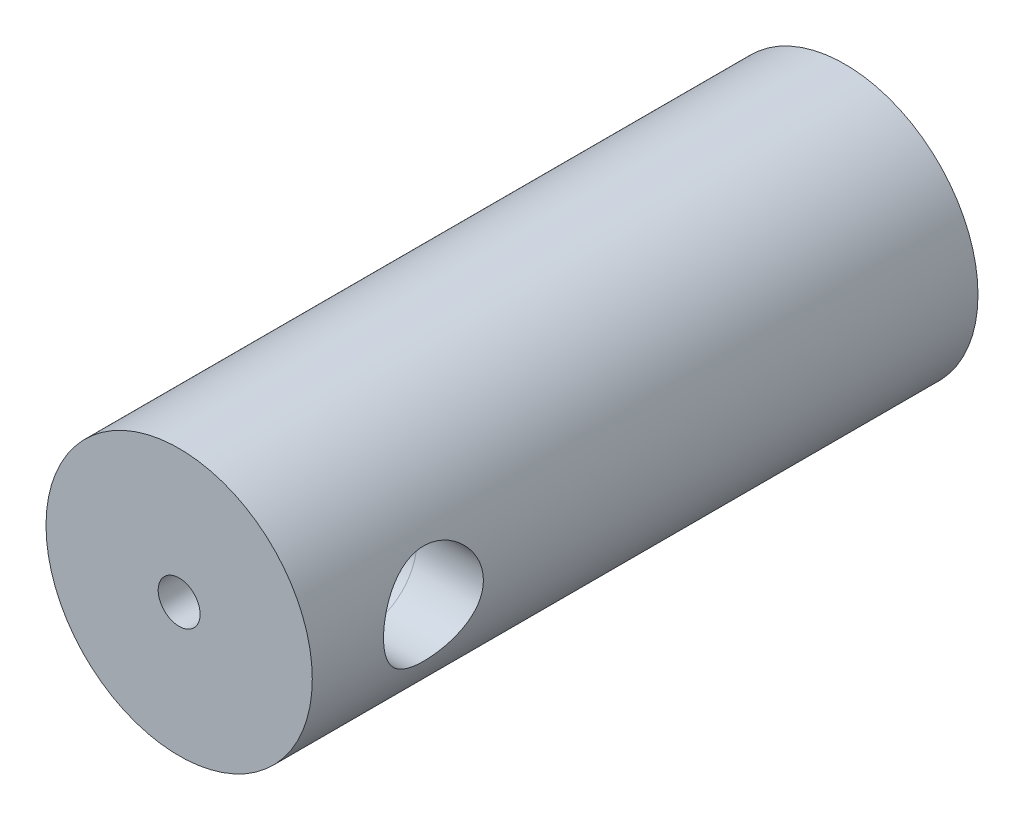
ISO-10303-21;
HEADER;
FILE_DESCRIPTION(('STEP AP214'),'2;1');
FILE_NAME('part.step','',(''),(''),'','','');
FILE_SCHEMA(('AUTOMOTIVE_DESIGN { 1 0 10303 214 1 1 1 1 }'));
ENDSEC;
DATA;
#1=APPLICATION_CONTEXT('core data for automotive mechanical design processes');
#2=APPLICATION_PROTOCOL_DEFINITION('international standard','automotive_design',2000,#1);
#3=PRODUCT_CONTEXT('',#1,'mechanical');
#4=PRODUCT('Part','Part','',(#3));
#5=PRODUCT_RELATED_PRODUCT_CATEGORY('part','',(#4));
#6=PRODUCT_DEFINITION_FORMATION('','',#4);
#7=PRODUCT_DEFINITION_CONTEXT('part definition',#1,'design');
#8=PRODUCT_DEFINITION('design','',#6,#7);
#9=PRODUCT_DEFINITION_SHAPE('','',#8);
#10=(LENGTH_UNIT() NAMED_UNIT(*) SI_UNIT(.MILLI.,.METRE.));
#11=(NAMED_UNIT(*) PLANE_ANGLE_UNIT() SI_UNIT($,.RADIAN.));
#12=(NAMED_UNIT(*) SI_UNIT($,.STERADIAN.) SOLID_ANGLE_UNIT());
#13=UNCERTAINTY_MEASURE_WITH_UNIT(LENGTH_MEASURE(1.E-05),#10,'distance_accuracy_value','');
#14=(GEOMETRIC_REPRESENTATION_CONTEXT(3) GLOBAL_UNCERTAINTY_ASSIGNED_CONTEXT((#13)) GLOBAL_UNIT_ASSIGNED_CONTEXT((#10,
#11,#12)) REPRESENTATION_CONTEXT('',''));
#15=CARTESIAN_POINT('',(0.,0.,0.));
#16=DIRECTION('',(0.,0.,1.));
#17=DIRECTION('',(1.,0.,0.));
#18=AXIS2_PLACEMENT_3D('',#15,#16,#17);
#19=CARTESIAN_POINT('',(0.,0.,0.));
#20=DIRECTION('',(0.,0.,1.));
#21=DIRECTION('',(1.,0.,0.));
#22=AXIS2_PLACEMENT_3D('',#19,#20,#21);
#23=PLANE('',#22);
#24=CARTESIAN_POINT('',(0.,0.,0.));
#25=DIRECTION('',(0.,0.,1.));
#26=DIRECTION('',(1.,0.,0.));
#27=AXIS2_PLACEMENT_3D('',#24,#25,#26);
#28=CIRCLE('',#27,20.);
#29=CARTESIAN_POINT('',(20.,0.,0.));
#30=VERTEX_POINT('',#29);
#31=EDGE_CURVE('E134',#30,#30,#28,.T.);
#32=ORIENTED_EDGE('',*,*,#31,.F.);
#33=EDGE_LOOP('',(#32));
#34=FACE_BOUND('',#33,.T.);
#35=CARTESIAN_POINT('',(0.,0.,0.));
#36=DIRECTION('',(0.,0.,1.));
#37=DIRECTION('',(1.,0.,0.));
#38=AXIS2_PLACEMENT_3D('',#35,#36,#37);
#39=CIRCLE('',#38,9.75);
#40=CARTESIAN_POINT('',(-2.5,9.42403841248538,0.));
#41=VERTEX_POINT('',#40);
#42=CARTESIAN_POINT('',(2.5,9.42403841248538,0.));
#43=VERTEX_POINT('',#42);
#44=EDGE_CURVE('E116',#41,#43,#39,.T.);
#45=ORIENTED_EDGE('',*,*,#44,.T.);
#46=DIRECTION('',(0.,-1.,0.));
#47=VECTOR('',#46,1.);
#48=CARTESIAN_POINT('',(2.5,13.75,0.));
#49=LINE('',#48,#47);
#50=CARTESIAN_POINT('',(2.5,13.75,0.));
#51=VERTEX_POINT('',#50);
#52=EDGE_CURVE('E103',#51,#43,#49,.T.);
#53=ORIENTED_EDGE('',*,*,#52,.F.);
#54=DIRECTION('',(-1.,0.,0.));
#55=VECTOR('',#54,1.);
#56=CARTESIAN_POINT('',(2.5,13.75,0.));
#57=LINE('',#56,#55);
#58=CARTESIAN_POINT('',(-2.5,13.75,0.));
#59=VERTEX_POINT('',#58);
#60=EDGE_CURVE('E109',#51,#59,#57,.T.);
#61=ORIENTED_EDGE('',*,*,#60,.T.);
#62=DIRECTION('',(0.,-1.,0.));
#63=VECTOR('',#62,1.);
#64=CARTESIAN_POINT('',(-2.5,13.75,0.));
#65=LINE('',#64,#63);
#66=EDGE_CURVE('E113',#59,#41,#65,.T.);
#67=ORIENTED_EDGE('',*,*,#66,.T.);
#68=EDGE_LOOP('',(#45,#53,#61,#67));
#69=FACE_BOUND('',#68,.T.);
#70=ADVANCED_FACE('F57',(#34,#69),#23,.F.);
#71=CARTESIAN_POINT('',(0.,0.,100.));
#72=DIRECTION('',(0.,0.,-1.));
#73=DIRECTION('',(-1.,0.,0.));
#74=AXIS2_PLACEMENT_3D('',#71,#72,#73);
#75=CYLINDRICAL_SURFACE('',#74,20.);
#76=CARTESIAN_POINT('',(0.,0.,100.));
#77=DIRECTION('',(0.,0.,1.));
#78=DIRECTION('',(1.,0.,0.));
#79=AXIS2_PLACEMENT_3D('',#76,#77,#78);
#80=CIRCLE('',#79,20.);
#81=CARTESIAN_POINT('',(20.,0.,100.));
#82=VERTEX_POINT('',#81);
#83=EDGE_CURVE('E67',#82,#82,#80,.T.);
#84=ORIENTED_EDGE('',*,*,#83,.F.);
#85=EDGE_LOOP('',(#84));
#86=FACE_BOUND('',#85,.T.);
#87=ORIENTED_EDGE('',*,*,#31,.T.);
#88=EDGE_LOOP('',(#87));
#89=FACE_BOUND('',#88,.T.);
#90=CARTESIAN_POINT('',(20.,0.,74.2938834486489));
#91=CARTESIAN_POINT('',(20.0000006949911,0.203070968021459,74.2938825011936));
#92=CARTESIAN_POINT('',(19.9969005176281,0.406128872036972,74.3021372739096));
#93=CARTESIAN_POINT('',(19.9845861075051,0.810722493053342,74.3350686721892));
#94=CARTESIAN_POINT('',(19.9753719932571,1.01225823948296,74.3597449794395));
#95=CARTESIAN_POINT('',(19.9510804699548,1.41228165684716,74.4252652052667));
#96=CARTESIAN_POINT('',(19.9360041221055,1.61076987270177,74.4661061976716));
#97=CARTESIAN_POINT('',(19.9003893947718,2.00333465937662,74.5635616330823));
#98=CARTESIAN_POINT('',(19.8798508703887,2.19741111301496,74.6201764945335));
#99=CARTESIAN_POINT('',(19.8338980424643,2.57942334484994,74.7485238813045));
#100=CARTESIAN_POINT('',(19.8084943914583,2.76737150814739,74.8202234108822));
#101=CARTESIAN_POINT('',(19.7534187407954,3.13644330297231,74.9782370976797));
#102=CARTESIAN_POINT('',(19.7237452567773,3.31756453344304,75.0645563391395));
#103=CARTESIAN_POINT('',(19.6608785037209,3.67181392735243,75.2511124295837));
#104=CARTESIAN_POINT('',(19.6276857148228,3.84494317652612,75.3513473806179));
#105=CARTESIAN_POINT('',(19.5585744043947,4.18232397222971,75.5650745947781));
#106=CARTESIAN_POINT('',(19.5226549005367,4.34657228246888,75.6785716437325));
#107=CARTESIAN_POINT('',(19.4475600773382,4.67132012701298,75.9226330219386));
#108=CARTESIAN_POINT('',(19.4083128458309,4.83143819793328,76.0536829700604));
#109=CARTESIAN_POINT('',(19.328838303106,5.14017756215578,76.3284211117974));
#110=CARTESIAN_POINT('',(19.2886109633058,5.28879851964385,76.4721096743065));
#111=CARTESIAN_POINT('',(19.2082062022255,5.57375496212915,76.771338402275));
#112=CARTESIAN_POINT('',(19.1680288125827,5.71008474111935,76.9268840109929));
#113=CARTESIAN_POINT('',(19.0888249186339,5.96951895886719,77.2488237377724));
#114=CARTESIAN_POINT('',(19.0497980301105,6.09262784997175,77.4152141731386));
#115=CARTESIAN_POINT('',(18.9724859555749,6.32936647954693,77.7645731589389));
#116=CARTESIAN_POINT('',(18.9342875038848,6.44244711735878,77.9479336658511));
#117=CARTESIAN_POINT('',(18.8614640429767,6.65263459332164,78.3241763915298));
#118=CARTESIAN_POINT('',(18.826837602539,6.74974783856143,78.5170547505649));
#119=CARTESIAN_POINT('',(18.7622651010258,6.92721666163355,78.9111145899574));
#120=CARTESIAN_POINT('',(18.732318593607,7.00757383780174,79.1122952761735));
#121=CARTESIAN_POINT('',(18.6781264228347,7.1507665901449,79.5215442571735));
#122=CARTESIAN_POINT('',(18.6538804250933,7.21360319410448,79.7296121471418));
#123=CARTESIAN_POINT('',(18.6128171932609,7.3188864092305,80.1424010878224));
#124=CARTESIAN_POINT('',(18.5957361566855,7.36206332770832,80.3469096454774));
#125=CARTESIAN_POINT('',(18.5682025890409,7.43123437452077,80.7592563383945));
#126=CARTESIAN_POINT('',(18.5577498877569,7.4572289440963,80.9670943880152));
#127=CARTESIAN_POINT('',(18.5438461337811,7.49173666070089,81.3843766904721));
#128=CARTESIAN_POINT('',(18.5403925915472,7.50025602352703,81.5938203455907));
#129=CARTESIAN_POINT('',(18.5406045750876,7.49973228101478,82.0126779142968));
#130=CARTESIAN_POINT('',(18.5442698247326,7.49068985687681,82.2220918287227));
#131=CARTESIAN_POINT('',(18.5581541826773,7.45622070727225,82.6266357949813));
#132=CARTESIAN_POINT('',(18.5679659887167,7.43181178035891,82.8218676270276));
#133=CARTESIAN_POINT('',(18.5934550735589,7.36780931755873,83.2095063094472));
#134=CARTESIAN_POINT('',(18.6091343980122,7.32821048574541,83.4019121502259));
#135=CARTESIAN_POINT('',(18.6458755071589,7.23421503229473,83.7824869262937));
#136=CARTESIAN_POINT('',(18.6669358543613,7.17982236244592,83.9706569785499));
#137=CARTESIAN_POINT('',(18.7138316388318,7.05668780060369,84.3417028520011));
#138=CARTESIAN_POINT('',(18.7396689024681,6.98794041903922,84.5245766172199));
#139=CARTESIAN_POINT('',(18.7959041471208,6.83525595221402,84.8872142462722));
#140=CARTESIAN_POINT('',(18.8263777414694,6.75106109551286,85.0668577612196));
#141=CARTESIAN_POINT('',(18.8906847573172,6.56896880176203,85.4185031761953));
#142=CARTESIAN_POINT('',(18.9245193195636,6.47106670768666,85.5905024528234));
#143=CARTESIAN_POINT('',(18.9946467838013,6.26222988156312,85.925893454014));
#144=CARTESIAN_POINT('',(19.0309399609969,6.15129368952391,86.0892842113338));
#145=CARTESIAN_POINT('',(19.1050600058862,5.91707432475699,86.4065965981358));
#146=CARTESIAN_POINT('',(19.1428869428418,5.79379059406597,86.5605177991976));
#147=CARTESIAN_POINT('',(19.2217192251952,5.52685758549759,86.8681383312753));
#148=CARTESIAN_POINT('',(19.2627668694648,5.38239554850842,87.0211225300534));
#149=CARTESIAN_POINT('',(19.3444196466276,5.08111960259879,87.3144278915546));
#150=CARTESIAN_POINT('',(19.3850249099682,4.9243094535767,87.4547528811928));
#151=CARTESIAN_POINT('',(19.4647378562275,4.59913178437368,87.7219771706626));
#152=CARTESIAN_POINT('',(19.5038447299098,4.4307581524274,87.8488692792245));
#153=CARTESIAN_POINT('',(19.5794735643872,4.08359626326275,88.0882202266966));
#154=CARTESIAN_POINT('',(19.6159965527517,3.90481219826151,88.2006848178338));
#155=CARTESIAN_POINT('',(19.6860423205742,3.53492899562548,88.4120681535395));
#156=CARTESIAN_POINT('',(19.7195078794209,3.34367879554688,88.5107419190484));
#157=CARTESIAN_POINT('',(19.7818042347176,2.95285527289817,88.6914900333154));
#158=CARTESIAN_POINT('',(19.8106369862409,2.75328550625454,88.7735713879671));
#159=CARTESIAN_POINT('',(19.8628434264484,2.34719996217688,88.9204015192833));
#160=CARTESIAN_POINT('',(19.8862178749036,2.14068515604437,88.9851527084115));
#161=CARTESIAN_POINT('',(19.9268153054777,1.72226565642152,89.0966685223494));
#162=CARTESIAN_POINT('',(19.9440386557731,1.5103612863393,89.1434342237007));
#163=CARTESIAN_POINT('',(19.9710730258303,1.09424775972726,89.2164734938672));
#164=CARTESIAN_POINT('',(19.9812295417902,0.890228709079153,89.2437046257716));
#165=CARTESIAN_POINT('',(19.9952797490968,0.480429861153437,89.2813075022969));
#166=CARTESIAN_POINT('',(19.9991736625905,0.274650126591165,89.2916798449332));
#167=CARTESIAN_POINT('',(20.0005896492051,-0.137045616648888,89.2954558724119));
#168=CARTESIAN_POINT('',(19.9981129628774,-0.342961590989924,89.2888628609298));
#169=CARTESIAN_POINT('',(19.9868596574388,-0.75337984881987,89.2587848997777));
#170=CARTESIAN_POINT('',(19.9780831342252,-0.957882153780105,89.2353002072363));
#171=CARTESIAN_POINT('',(19.9549324504254,-1.35605980169529,89.1729165954862));
#172=CARTESIAN_POINT('',(19.9407879695859,-1.54984794134557,89.1346491234203));
#173=CARTESIAN_POINT('',(19.9072569807347,-1.93344269290831,89.0430693283587));
#174=CARTESIAN_POINT('',(19.887868626756,-2.1232478773237,88.9897517070662));
#175=CARTESIAN_POINT('',(19.8443406080703,-2.49752579570185,88.8685600525246));
#176=CARTESIAN_POINT('',(19.8202022917965,-2.68200002602577,88.8006901499308));
#177=CARTESIAN_POINT('',(19.7677484774414,-3.04461799000738,88.6509090496575));
#178=CARTESIAN_POINT('',(19.7394313942141,-3.22275928941149,88.5689925217043));
#179=CARTESIAN_POINT('',(19.6784277420874,-3.57668241852781,88.3891754419566));
#180=CARTESIAN_POINT('',(19.6456382523032,-3.75224591151486,88.2908801609634));
#181=CARTESIAN_POINT('',(19.5771555886676,-4.09456511700747,88.0807655174246));
#182=CARTESIAN_POINT('',(19.5414614186652,-4.26131777525404,87.9689415087907));
#183=CARTESIAN_POINT('',(19.4680439258145,-4.58506525872597,87.7325162883983));
#184=CARTESIAN_POINT('',(19.4303203062301,-4.74205864972659,87.6079132057198));
#185=CARTESIAN_POINT('',(19.3537631643409,-5.04542669379828,87.3466971694549));
#186=CARTESIAN_POINT('',(19.3149296015203,-5.19180095855238,87.2100837770827));
#187=CARTESIAN_POINT('',(19.2348304666649,-5.4813462403016,86.9173256371552));
#188=CARTESIAN_POINT('',(19.1935550246388,-5.62383372222469,86.7605066744072));
#189=CARTESIAN_POINT('',(19.1119813103232,-5.89510225689365,86.4352836362986));
#190=CARTESIAN_POINT('',(19.071682729132,-6.02388768732424,86.2668832895691));
#191=CARTESIAN_POINT('',(18.9931802921809,-6.26701151435384,85.9193600322703));
#192=CARTESIAN_POINT('',(18.9549774947293,-6.38134264929433,85.7402317982143));
#193=CARTESIAN_POINT('',(18.881842233177,-6.59459943128484,85.3724887289153));
#194=CARTESIAN_POINT('',(18.8469083964192,-6.69353155615769,85.1838779270717));
#195=CARTESIAN_POINT('',(18.7812317544015,-6.87566403749446,84.7973959804677));
#196=CARTESIAN_POINT('',(18.7505091923228,-6.95878910381581,84.5994858541344));
#197=CARTESIAN_POINT('',(18.694480634226,-7.10793535121494,84.1966649688911));
#198=CARTESIAN_POINT('',(18.6691723687546,-7.17396370099289,83.9917571850453));
#199=CARTESIAN_POINT('',(18.6248465673625,-7.28826820106416,83.5764429068598));
#200=CARTESIAN_POINT('',(18.6058271216825,-7.33654974112424,83.3660381028109));
#201=CARTESIAN_POINT('',(18.5747639414794,-7.41484504718195,82.9413522612139));
#202=CARTESIAN_POINT('',(18.5627197204411,-7.44486008725788,82.7270714950858));
#203=CARTESIAN_POINT('',(18.5465933049917,-7.48493863022116,82.3102824551219));
#204=CARTESIAN_POINT('',(18.5420491539834,-7.4961604056798,82.1079026474111));
#205=CARTESIAN_POINT('',(18.5396138019941,-7.5021819174978,81.7028610146104));
#206=CARTESIAN_POINT('',(18.5417223790381,-7.49698220177711,81.5001991991556));
#207=CARTESIAN_POINT('',(18.5525209844085,-7.4702189157973,81.0961592525601));
#208=CARTESIAN_POINT('',(18.5612103739758,-7.44865693372293,80.8947809987448));
#209=CARTESIAN_POINT('',(18.5848804234321,-7.38940016534892,80.4947908378965));
#210=CARTESIAN_POINT('',(18.5998610789405,-7.35170539028268,80.2961789289373));
#211=CARTESIAN_POINT('',(18.6350757989785,-7.26196897505606,79.9091982990506));
#212=CARTESIAN_POINT('',(18.655133955521,-7.21040468493111,79.7207024642879));
#213=CARTESIAN_POINT('',(18.7001191111151,-7.09291899633679,79.3487758547288));
#214=CARTESIAN_POINT('',(18.7250477129692,-7.02699287074365,79.1653467700793));
#215=CARTESIAN_POINT('',(18.7790659217203,-6.88133055609669,78.8047213581384));
#216=CARTESIAN_POINT('',(18.8081548517944,-6.80159661292323,78.6275240228659));
#217=CARTESIAN_POINT('',(18.8697152850299,-6.62889488784757,78.2802804431833));
#218=CARTESIAN_POINT('',(18.9021880991186,-6.53592197197538,78.1102370062944));
#219=CARTESIAN_POINT('',(19.0069536143875,-6.2277137240126,77.5949563578366));
#220=CARTESIAN_POINT('',(19.0836670851801,-5.99071861556498,77.2633181287321));
#221=CARTESIAN_POINT('',(19.2403301804045,-5.46664728657928,76.643086951488));
#222=CARTESIAN_POINT('',(19.3202808271434,-5.17955514905406,76.3545077384175));
#223=CARTESIAN_POINT('',(19.438676663767,-4.70809408633241,75.9518132678851));
#224=CARTESIAN_POINT('',(19.4788882496359,-4.53926103129734,75.8196777789076));
#225=CARTESIAN_POINT('',(19.55686920485,-4.19055225393182,75.5701237126359));
#226=CARTESIAN_POINT('',(19.5946394801554,-4.01068067682134,75.4526996606322));
#227=CARTESIAN_POINT('',(19.6667051020052,-3.6409088062972,75.2333937635382));
#228=CARTESIAN_POINT('',(19.7009985836445,-3.45100321297443,75.131520244886));
#229=CARTESIAN_POINT('',(19.7651027001156,-3.06258638682355,74.9442834146511));
#230=CARTESIAN_POINT('',(19.7949152332913,-2.86407884437145,74.8589131071087));
#231=CARTESIAN_POINT('',(19.8503942615567,-2.45094825989374,74.7020731372954));
#232=CARTESIAN_POINT('',(19.8758228421911,-2.23600002200006,74.6313733309101));
#233=CARTESIAN_POINT('',(19.9200461241093,-1.79994016793749,74.5095535387856));
#234=CARTESIAN_POINT('',(19.9388404924467,-1.57882824303678,74.4584345357231));
#235=CARTESIAN_POINT('',(19.969163307367,-1.13248745661206,74.3764083396845));
#236=CARTESIAN_POINT('',(19.9806948101893,-0.907260367875009,74.345492644879));
#237=CARTESIAN_POINT('',(19.9961123363293,-0.454683233786637,74.30423188976));
#238=CARTESIAN_POINT('',(19.9999992219729,-0.227333430788376,74.293884509304));
#239=CARTESIAN_POINT('',(20.,0.,74.2938834486489));
#240=B_SPLINE_CURVE_WITH_KNOTS('',3,(#90,#91,#92,#93,#94,#95,#96,#97,#98,#99,#100,#101,#102,
#103,#104,#105,#106,#107,#108,#109,#110,#111,#112,#113,#114,#115,#116,#117,#118,#119,#120,#121,
#122,#123,#124,#125,#126,#127,#128,#129,#130,#131,#132,#133,#134,#135,#136,#137,#138,#139,#140,
#141,#142,#143,#144,#145,#146,#147,#148,#149,#150,#151,#152,#153,#154,#155,#156,#157,#158,#159,
#160,#161,#162,#163,#164,#165,#166,#167,#168,#169,#170,#171,#172,#173,#174,#175,#176,#177,#178,
#179,#180,#181,#182,#183,#184,#185,#186,#187,#188,#189,#190,#191,#192,#193,#194,#195,#196,#197,
#198,#199,#200,#201,#202,#203,#204,#205,#206,#207,#208,#209,#210,#211,#212,#213,#214,#215,#216,
#217,#218,#219,#220,#221,#222,#223,#224,#225,#226,#227,#228,#229,#230,#231,#232,#233,#234,#235,
#236,#237,#238,#239),.UNSPECIFIED.,.T.,.F.,(4,2,2,2,2,2,2,2,2,2,2,2,2,2,2,2,2,2,2,2,2,2,2,2,2,2,
2,2,2,2,2,2,2,2,2,2,2,2,2,2,2,2,2,2,2,2,2,2,2,2,2,2,2,2,2,2,2,2,2,2,2,2,2,2,2,2,2,2,2,2,2,2,2,2,
4),(0.,0.608999956569121,1.2179881086895,1.82686607061669,2.43576018624771,3.04333602101901,
3.65112358554747,4.25882833580728,4.86675306673733,5.49784759802492,6.12896055572049,
6.76036500614003,7.39155614970225,8.04710389078631,8.70238794089193,9.35760945582954,
10.0127925263413,10.6411154155012,11.2694221687695,11.8975053993619,12.5255642678541,
13.1158609555577,13.706363636216,14.2967087341194,14.8872800083734,15.48879042923,
16.0905057110534,16.6922884573043,17.294098409327,17.9364976383173,18.5787020128302,
19.2212484699716,19.8635379434159,20.5160836111604,21.1683531732238,21.8205318881423,
22.4726715600923,23.0901283371345,23.7075632112555,24.3248778609402,24.9421831139336,
25.5356078324118,26.129241722893,26.7227073333315,27.3163986465876,27.9273114640636,
28.5384346823473,29.149647500183,29.760882657408,30.407730978247,31.0543720122049,
31.7013366304338,32.3480283535228,32.9977271255338,33.647153034297,34.2963815469097,
34.9455647710003,35.5530262644448,36.1604674895258,36.7678497615569,37.375231610664,
37.96391674576,38.5527959370655,39.1415794353244,39.7305918841889,40.9691711455771,
42.2081446512166,42.8618687687023,43.5153488822951,44.169177679639,44.8227286983722,
45.5048205241399,46.186946576693,46.8687853960765,47.5505472984583),.UNSPECIFIED.);
#241=CARTESIAN_POINT('',(20.,0.,74.2938834486489));
#242=VERTEX_POINT('',#241);
#243=EDGE_CURVE('E12',#242,#242,#240,.T.);
#244=ORIENTED_EDGE('',*,*,#243,.F.);
#245=EDGE_LOOP('',(#244));
#246=FACE_BOUND('',#245,.T.);
#247=ADVANCED_FACE('F59',(#86,#89,#246),#75,.T.);
#248=CARTESIAN_POINT('',(0.,0.,100.));
#249=DIRECTION('',(0.,0.,1.));
#250=DIRECTION('',(1.,0.,0.));
#251=AXIS2_PLACEMENT_3D('',#248,#249,#250);
#252=PLANE('',#251);
#253=CARTESIAN_POINT('',(0.,0.,100.));
#254=DIRECTION('',(0.,0.,1.));
#255=DIRECTION('',(1.,0.,0.));
#256=AXIS2_PLACEMENT_3D('',#253,#254,#255);
#257=CIRCLE('',#256,3.15);
#258=CARTESIAN_POINT('',(3.15,0.,100.));
#259=VERTEX_POINT('',#258);
#260=EDGE_CURVE('E130',#259,#259,#257,.T.);
#261=ORIENTED_EDGE('',*,*,#260,.F.);
#262=EDGE_LOOP('',(#261));
#263=FACE_BOUND('',#262,.T.);
#264=ORIENTED_EDGE('',*,*,#83,.T.);
#265=EDGE_LOOP('',(#264));
#266=FACE_BOUND('',#265,.T.);
#267=ADVANCED_FACE('F158',(#263,#266),#252,.T.);
#268=CARTESIAN_POINT('',(0.,0.,95.));
#269=DIRECTION('',(0.,0.,1.));
#270=DIRECTION('',(1.,0.,0.));
#271=AXIS2_PLACEMENT_3D('',#268,#269,#270);
#272=CYLINDRICAL_SURFACE('',#271,3.15);
#273=CARTESIAN_POINT('',(0.,0.,95.));
#274=DIRECTION('',(0.,0.,1.));
#275=DIRECTION('',(1.,0.,0.));
#276=AXIS2_PLACEMENT_3D('',#273,#274,#275);
#277=CIRCLE('',#276,3.15);
#278=CARTESIAN_POINT('',(3.15,0.,95.));
#279=VERTEX_POINT('',#278);
#280=EDGE_CURVE('E131',#279,#279,#277,.T.);
#281=ORIENTED_EDGE('',*,*,#280,.F.);
#282=EDGE_LOOP('',(#281));
#283=FACE_BOUND('',#282,.T.);
#284=ORIENTED_EDGE('',*,*,#260,.T.);
#285=EDGE_LOOP('',(#284));
#286=FACE_BOUND('',#285,.T.);
#287=ADVANCED_FACE('F154',(#283,#286),#272,.F.);
#288=CARTESIAN_POINT('',(0.,0.,95.));
#289=DIRECTION('',(0.,0.,1.));
#290=DIRECTION('',(1.,0.,0.));
#291=AXIS2_PLACEMENT_3D('',#288,#289,#290);
#292=PLANE('',#291);
#293=ORIENTED_EDGE('',*,*,#280,.T.);
#294=EDGE_LOOP('',(#293));
#295=FACE_BOUND('',#294,.T.);
#296=ADVANCED_FACE('F149',(#295),#292,.T.);
#297=CARTESIAN_POINT('',(9.99999999999999,0.,81.7938834486489));
#298=DIRECTION('',(1.,0.,0.));
#299=DIRECTION('',(0.,0.,-1.));
#300=AXIS2_PLACEMENT_3D('',#297,#298,#299);
#301=CYLINDRICAL_SURFACE('',#300,7.5);
#302=CARTESIAN_POINT('',(9.99999999999999,0.,81.7938834486489));
#303=DIRECTION('',(-1.,0.,0.));
#304=DIRECTION('',(0.,0.,1.));
#305=AXIS2_PLACEMENT_3D('',#302,#303,#304);
#306=CIRCLE('',#305,7.5);
#307=CARTESIAN_POINT('',(9.99999999999999,0.,89.2938834486489));
#308=VERTEX_POINT('',#307);
#309=EDGE_CURVE('E127',#308,#308,#306,.T.);
#310=ORIENTED_EDGE('',*,*,#309,.T.);
#311=EDGE_LOOP('',(#310));
#312=FACE_BOUND('',#311,.T.);
#313=ORIENTED_EDGE('',*,*,#243,.T.);
#314=EDGE_LOOP('',(#313));
#315=FACE_BOUND('',#314,.T.);
#316=ADVANCED_FACE('F143',(#312,#315),#301,.F.);
#317=CARTESIAN_POINT('',(10.,0.,71.7938834486489));
#318=DIRECTION('',(0.,1.,0.));
#319=DIRECTION('',(0.,0.,1.));
#320=AXIS2_PLACEMENT_3D('',#317,#318,#319);
#321=TOROIDAL_SURFACE('',#320,10.,7.5);
#322=CARTESIAN_POINT('',(0.,0.,71.7938834486489));
#323=DIRECTION('',(0.,0.,-1.));
#324=DIRECTION('',(-1.,0.,0.));
#325=AXIS2_PLACEMENT_3D('',#322,#323,#324);
#326=CIRCLE('',#325,7.5);
#327=CARTESIAN_POINT('',(-7.5,0.,71.7938834486489));
#328=VERTEX_POINT('',#327);
#329=EDGE_CURVE('E124',#328,#328,#326,.T.);
#330=CARTESIAN_POINT('',(10.,0.,71.7938834486489));
#331=DIRECTION('',(0.,1.,0.));
#332=DIRECTION('',(0.,0.,1.));
#333=AXIS2_PLACEMENT_3D('',#330,#331,#332);
#334=CIRCLE('',#333,17.5);
#335=EDGE_CURVE('',#328,#308,#334,.T.);
#336=ORIENTED_EDGE('',*,*,#329,.T.);
#337=ORIENTED_EDGE('',*,*,#309,.F.);
#338=ORIENTED_EDGE('',*,*,#335,.T.);
#339=ORIENTED_EDGE('',*,*,#335,.F.);
#340=EDGE_LOOP('',(#336,#338,#337,#339));
#341=FACE_BOUND('',#340,.T.);
#342=ADVANCED_FACE('F148',(#341),#321,.F.);
#343=CARTESIAN_POINT('',(0.,0.,71.7938834486489));
#344=DIRECTION('',(0.,0.,-1.));
#345=DIRECTION('',(-1.,0.,0.));
#346=AXIS2_PLACEMENT_3D('',#343,#344,#345);
#347=CYLINDRICAL_SURFACE('',#346,7.5);
#348=CARTESIAN_POINT('',(0.,0.,10.));
#349=DIRECTION('',(0.,0.,1.));
#350=DIRECTION('',(1.,0.,0.));
#351=AXIS2_PLACEMENT_3D('',#348,#349,#350);
#352=CIRCLE('',#351,7.5);
#353=CARTESIAN_POINT('',(7.5,0.,10.));
#354=VERTEX_POINT('',#353);
#355=EDGE_CURVE('E62',#354,#354,#352,.F.);
#356=ORIENTED_EDGE('',*,*,#355,.T.);
#357=EDGE_LOOP('',(#356));
#358=FACE_BOUND('',#357,.T.);
#359=ORIENTED_EDGE('',*,*,#329,.F.);
#360=EDGE_LOOP('',(#359));
#361=FACE_BOUND('',#360,.T.);
#362=ADVANCED_FACE('F199',(#358,#361),#347,.F.);
#363=CARTESIAN_POINT('',(0.,0.,10.));
#364=DIRECTION('',(0.,0.,1.));
#365=DIRECTION('',(1.,0.,0.));
#366=AXIS2_PLACEMENT_3D('',#363,#364,#365);
#367=PLANE('',#366);
#368=DIRECTION('',(0.,-1.,0.));
#369=VECTOR('',#368,1.);
#370=CARTESIAN_POINT('',(-2.5,13.75,10.));
#371=LINE('',#370,#369);
#372=CARTESIAN_POINT('',(-2.5,13.75,10.));
#373=VERTEX_POINT('',#372);
#374=CARTESIAN_POINT('',(-2.5,9.42403841248538,10.));
#375=VERTEX_POINT('',#374);
#376=EDGE_CURVE('E119',#373,#375,#371,.T.);
#377=ORIENTED_EDGE('',*,*,#376,.F.);
#378=DIRECTION('',(-1.,0.,0.));
#379=VECTOR('',#378,1.);
#380=CARTESIAN_POINT('',(2.5,13.75,10.));
#381=LINE('',#380,#379);
#382=CARTESIAN_POINT('',(2.5,13.75,10.));
#383=VERTEX_POINT('',#382);
#384=EDGE_CURVE('E117',#383,#373,#381,.T.);
#385=ORIENTED_EDGE('',*,*,#384,.F.);
#386=DIRECTION('',(0.,-1.,0.));
#387=VECTOR('',#386,1.);
#388=CARTESIAN_POINT('',(2.5,13.75,10.));
#389=LINE('',#388,#387);
#390=CARTESIAN_POINT('',(2.5,9.42403841248538,10.));
#391=VERTEX_POINT('',#390);
#392=EDGE_CURVE('E105',#383,#391,#389,.T.);
#393=ORIENTED_EDGE('',*,*,#392,.T.);
#394=CARTESIAN_POINT('',(0.,0.,10.));
#395=DIRECTION('',(0.,0.,1.));
#396=DIRECTION('',(1.,0.,0.));
#397=AXIS2_PLACEMENT_3D('',#394,#395,#396);
#398=CIRCLE('',#397,9.75);
#399=EDGE_CURVE('E277',#375,#391,#398,.T.);
#400=ORIENTED_EDGE('',*,*,#399,.F.);
#401=EDGE_LOOP('',(#377,#385,#393,#400));
#402=FACE_BOUND('',#401,.T.);
#403=ORIENTED_EDGE('',*,*,#355,.F.);
#404=EDGE_LOOP('',(#403));
#405=FACE_BOUND('',#404,.T.);
#406=ADVANCED_FACE('F206',(#402,#405),#367,.F.);
#407=CARTESIAN_POINT('',(0.,0.,10.));
#408=DIRECTION('',(0.,0.,-1.));
#409=DIRECTION('',(-1.,0.,0.));
#410=AXIS2_PLACEMENT_3D('',#407,#408,#409);
#411=CYLINDRICAL_SURFACE('',#410,9.75);
#412=ORIENTED_EDGE('',*,*,#44,.F.);
#413=DIRECTION('',(0.,0.,-1.));
#414=VECTOR('',#413,1.);
#415=CARTESIAN_POINT('',(-2.5,9.42403841248538,10.));
#416=LINE('',#415,#414);
#417=EDGE_CURVE('E273',#375,#41,#416,.T.);
#418=ORIENTED_EDGE('',*,*,#417,.F.);
#419=ORIENTED_EDGE('',*,*,#399,.T.);
#420=DIRECTION('',(0.,0.,-1.));
#421=VECTOR('',#420,1.);
#422=CARTESIAN_POINT('',(2.5,9.42403841248538,10.));
#423=LINE('',#422,#421);
#424=EDGE_CURVE('E83',#391,#43,#423,.T.);
#425=ORIENTED_EDGE('',*,*,#424,.T.);
#426=EDGE_LOOP('',(#412,#418,#419,#425));
#427=FACE_BOUND('',#426,.T.);
#428=ADVANCED_FACE('F213',(#427),#411,.F.);
#429=CARTESIAN_POINT('',(-2.5,13.75,10.));
#430=DIRECTION('',(1.,0.,0.));
#431=DIRECTION('',(0.,1.,0.));
#432=AXIS2_PLACEMENT_3D('',#429,#430,#431);
#433=PLANE('',#432);
#434=ORIENTED_EDGE('',*,*,#66,.F.);
#435=DIRECTION('',(0.,0.,-1.));
#436=VECTOR('',#435,1.);
#437=CARTESIAN_POINT('',(-2.5,13.75,10.));
#438=LINE('',#437,#436);
#439=EDGE_CURVE('E74',#373,#59,#438,.T.);
#440=ORIENTED_EDGE('',*,*,#439,.F.);
#441=ORIENTED_EDGE('',*,*,#376,.T.);
#442=ORIENTED_EDGE('',*,*,#417,.T.);
#443=EDGE_LOOP('',(#434,#440,#441,#442));
#444=FACE_BOUND('',#443,.T.);
#445=ADVANCED_FACE('F216',(#444),#433,.T.);
#446=CARTESIAN_POINT('',(2.5,13.75,10.));
#447=DIRECTION('',(1.,0.,0.));
#448=DIRECTION('',(0.,1.,0.));
#449=AXIS2_PLACEMENT_3D('',#446,#447,#448);
#450=PLANE('',#449);
#451=ORIENTED_EDGE('',*,*,#424,.F.);
#452=ORIENTED_EDGE('',*,*,#392,.F.);
#453=DIRECTION('',(0.,0.,-1.));
#454=VECTOR('',#453,1.);
#455=CARTESIAN_POINT('',(2.5,13.75,10.));
#456=LINE('',#455,#454);
#457=EDGE_CURVE('E100',#383,#51,#456,.T.);
#458=ORIENTED_EDGE('',*,*,#457,.T.);
#459=ORIENTED_EDGE('',*,*,#52,.T.);
#460=EDGE_LOOP('',(#451,#452,#458,#459));
#461=FACE_BOUND('',#460,.T.);
#462=ADVANCED_FACE('F101',(#461),#450,.F.);
#463=CARTESIAN_POINT('',(2.5,13.75,10.));
#464=DIRECTION('',(0.,-1.,0.));
#465=DIRECTION('',(0.,0.,-1.));
#466=AXIS2_PLACEMENT_3D('',#463,#464,#465);
#467=PLANE('',#466);
#468=ORIENTED_EDGE('',*,*,#60,.F.);
#469=ORIENTED_EDGE('',*,*,#457,.F.);
#470=ORIENTED_EDGE('',*,*,#384,.T.);
#471=ORIENTED_EDGE('',*,*,#439,.T.);
#472=EDGE_LOOP('',(#468,#469,#470,#471));
#473=FACE_BOUND('',#472,.T.);
#474=ADVANCED_FACE('F110',(#473),#467,.T.);
#475=CLOSED_SHELL('',(#70,#247,#267,#287,#296,#316,#342,#362,#406,#428,#445,#462,#474));
#476=MANIFOLD_SOLID_BREP('B2',#475);
#477=ADVANCED_BREP_SHAPE_REPRESENTATION('',(#18,#476),#14);
#478=SHAPE_DEFINITION_REPRESENTATION(#9,#477);
ENDSEC;
END-ISO-10303-21;
